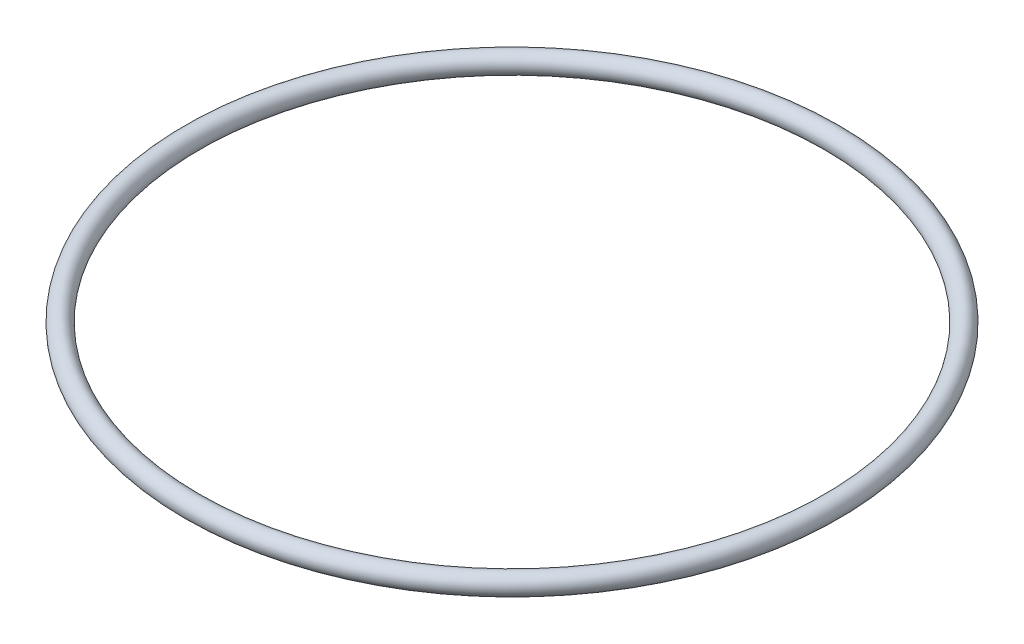
ISO-10303-21;
HEADER;
FILE_DESCRIPTION(('STEP AP214'),'2;1');
FILE_NAME('part.step','',(''),(''),'','','');
FILE_SCHEMA(('AUTOMOTIVE_DESIGN { 1 0 10303 214 1 1 1 1 }'));
ENDSEC;
DATA;
#1=APPLICATION_CONTEXT('core data for automotive mechanical design processes');
#2=APPLICATION_PROTOCOL_DEFINITION('international standard','automotive_design',2000,#1);
#3=PRODUCT_CONTEXT('',#1,'mechanical');
#4=PRODUCT('Part','Part','',(#3));
#5=PRODUCT_RELATED_PRODUCT_CATEGORY('part','',(#4));
#6=PRODUCT_DEFINITION_FORMATION('','',#4);
#7=PRODUCT_DEFINITION_CONTEXT('part definition',#1,'design');
#8=PRODUCT_DEFINITION('design','',#6,#7);
#9=PRODUCT_DEFINITION_SHAPE('','',#8);
#10=(LENGTH_UNIT() NAMED_UNIT(*) SI_UNIT(.MILLI.,.METRE.));
#11=(NAMED_UNIT(*) PLANE_ANGLE_UNIT() SI_UNIT($,.RADIAN.));
#12=(NAMED_UNIT(*) SI_UNIT($,.STERADIAN.) SOLID_ANGLE_UNIT());
#13=UNCERTAINTY_MEASURE_WITH_UNIT(LENGTH_MEASURE(1.E-05),#10,'distance_accuracy_value','');
#14=(GEOMETRIC_REPRESENTATION_CONTEXT(3) GLOBAL_UNCERTAINTY_ASSIGNED_CONTEXT((#13)) GLOBAL_UNIT_ASSIGNED_CONTEXT((#10,
#11,#12)) REPRESENTATION_CONTEXT('',''));
#15=CARTESIAN_POINT('',(0.,0.,0.));
#16=DIRECTION('',(0.,0.,1.));
#17=DIRECTION('',(1.,0.,0.));
#18=AXIS2_PLACEMENT_3D('',#15,#16,#17);
#19=CARTESIAN_POINT('',(0.,0.,0.));
#20=DIRECTION('',(0.,1.,0.));
#21=DIRECTION('',(0.,0.,1.));
#22=AXIS2_PLACEMENT_3D('',#19,#20,#21);
#23=TOROIDAL_SURFACE('',#22,50.8,1.5875);
#24=CARTESIAN_POINT('',(0.,0.,50.8));
#25=DIRECTION('',(1.,0.,0.));
#26=DIRECTION('',(0.,0.,-1.));
#27=AXIS2_PLACEMENT_3D('',#24,#25,#26);
#28=CIRCLE('',#27,1.5875);
#29=CARTESIAN_POINT('',(0.,0.,52.3875));
#30=VERTEX_POINT('',#29);
#31=EDGE_CURVE('E11',#30,#30,#28,.T.);
#32=CARTESIAN_POINT('',(0.,0.,0.));
#33=DIRECTION('',(0.,1.,0.));
#34=DIRECTION('',(0.,0.,1.));
#35=AXIS2_PLACEMENT_3D('',#32,#33,#34);
#36=CIRCLE('',#35,52.3875);
#37=EDGE_CURVE('',#30,#30,#36,.T.);
#38=ORIENTED_EDGE('',*,*,#31,.T.);
#39=ORIENTED_EDGE('',*,*,#31,.F.);
#40=ORIENTED_EDGE('',*,*,#37,.T.);
#41=ORIENTED_EDGE('',*,*,#37,.F.);
#42=EDGE_LOOP('',(#38,#40,#39,#41));
#43=FACE_BOUND('',#42,.T.);
#44=ADVANCED_FACE('F43',(#43),#23,.T.);
#45=CLOSED_SHELL('',(#44));
#46=MANIFOLD_SOLID_BREP('B2',#45);
#47=ADVANCED_BREP_SHAPE_REPRESENTATION('',(#18,#46),#14);
#48=SHAPE_DEFINITION_REPRESENTATION(#9,#47);
ENDSEC;
END-ISO-10303-21;
